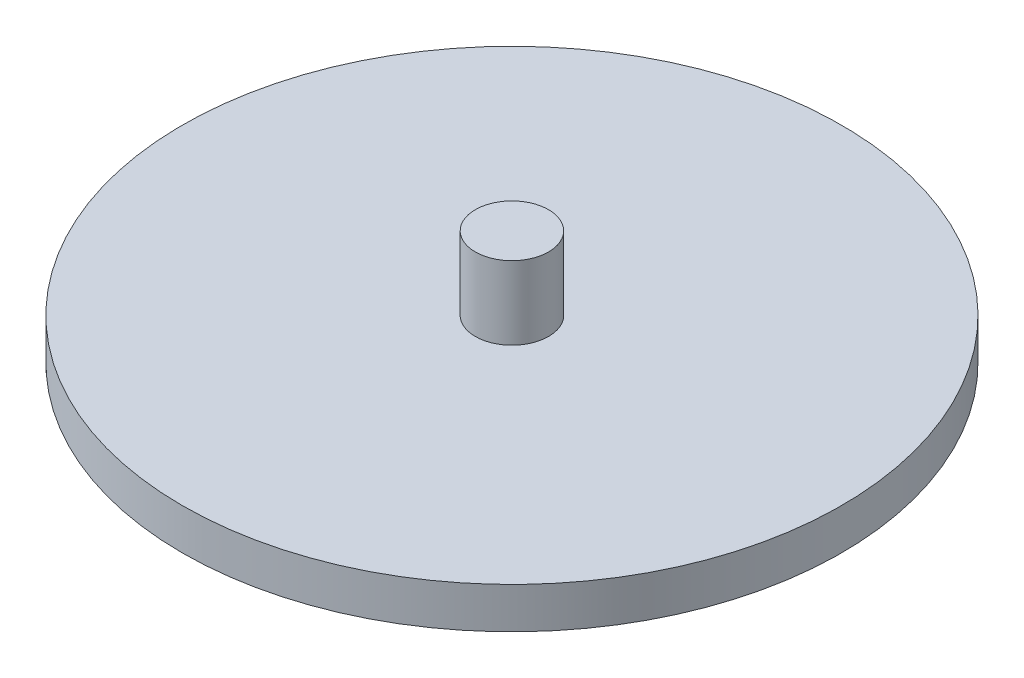
ISO-10303-21;
HEADER;
FILE_DESCRIPTION(('STEP AP214'),'2;1');
FILE_NAME('part.step','',(''),(''),'','','');
FILE_SCHEMA(('AUTOMOTIVE_DESIGN { 1 0 10303 214 1 1 1 1 }'));
ENDSEC;
DATA;
#1=APPLICATION_CONTEXT('core data for automotive mechanical design processes');
#2=APPLICATION_PROTOCOL_DEFINITION('international standard','automotive_design',2000,#1);
#3=PRODUCT_CONTEXT('',#1,'mechanical');
#4=PRODUCT('Part','Part','',(#3));
#5=PRODUCT_RELATED_PRODUCT_CATEGORY('part','',(#4));
#6=PRODUCT_DEFINITION_FORMATION('','',#4);
#7=PRODUCT_DEFINITION_CONTEXT('part definition',#1,'design');
#8=PRODUCT_DEFINITION('design','',#6,#7);
#9=PRODUCT_DEFINITION_SHAPE('','',#8);
#10=(LENGTH_UNIT() NAMED_UNIT(*) SI_UNIT(.MILLI.,.METRE.));
#11=(NAMED_UNIT(*) PLANE_ANGLE_UNIT() SI_UNIT($,.RADIAN.));
#12=(NAMED_UNIT(*) SI_UNIT($,.STERADIAN.) SOLID_ANGLE_UNIT());
#13=UNCERTAINTY_MEASURE_WITH_UNIT(LENGTH_MEASURE(1.E-05),#10,'distance_accuracy_value','');
#14=(GEOMETRIC_REPRESENTATION_CONTEXT(3) GLOBAL_UNCERTAINTY_ASSIGNED_CONTEXT((#13)) GLOBAL_UNIT_ASSIGNED_CONTEXT((#10,
#11,#12)) REPRESENTATION_CONTEXT('',''));
#15=CARTESIAN_POINT('',(0.,0.,0.));
#16=DIRECTION('',(0.,0.,1.));
#17=DIRECTION('',(1.,0.,0.));
#18=AXIS2_PLACEMENT_3D('',#15,#16,#17);
#19=CARTESIAN_POINT('',(0.,2.8,0.));
#20=DIRECTION('',(0.,-1.,0.));
#21=DIRECTION('',(0.,0.,-1.));
#22=AXIS2_PLACEMENT_3D('',#19,#20,#21);
#23=CYLINDRICAL_SURFACE('',#22,45.);
#24=CARTESIAN_POINT('',(0.,2.8,0.));
#25=DIRECTION('',(0.,1.,0.));
#26=DIRECTION('',(0.,0.,1.));
#27=AXIS2_PLACEMENT_3D('',#24,#25,#26);
#28=CIRCLE('',#27,45.);
#29=CARTESIAN_POINT('',(0.,2.8,45.));
#30=VERTEX_POINT('',#29);
#31=EDGE_CURVE('E10',#30,#30,#28,.T.);
#32=ORIENTED_EDGE('',*,*,#31,.F.);
#33=EDGE_LOOP('',(#32));
#34=FACE_BOUND('',#33,.T.);
#35=CARTESIAN_POINT('',(0.,-2.8,0.));
#36=DIRECTION('',(0.,1.,0.));
#37=DIRECTION('',(0.,0.,1.));
#38=AXIS2_PLACEMENT_3D('',#35,#36,#37);
#39=CIRCLE('',#38,45.);
#40=CARTESIAN_POINT('',(0.,-2.8,45.));
#41=VERTEX_POINT('',#40);
#42=EDGE_CURVE('E41',#41,#41,#39,.T.);
#43=ORIENTED_EDGE('',*,*,#42,.T.);
#44=EDGE_LOOP('',(#43));
#45=FACE_BOUND('',#44,.T.);
#46=ADVANCED_FACE('F34',(#34,#45),#23,.T.);
#47=CARTESIAN_POINT('',(0.,2.8,0.));
#48=DIRECTION('',(0.,1.,0.));
#49=DIRECTION('',(0.,0.,1.));
#50=AXIS2_PLACEMENT_3D('',#47,#48,#49);
#51=PLANE('',#50);
#52=CARTESIAN_POINT('',(0.,2.8,0.));
#53=DIRECTION('',(0.,1.,0.));
#54=DIRECTION('',(0.,0.,1.));
#55=AXIS2_PLACEMENT_3D('',#52,#53,#54);
#56=CIRCLE('',#55,5.);
#57=CARTESIAN_POINT('',(0.,2.8,5.));
#58=VERTEX_POINT('',#57);
#59=EDGE_CURVE('E48',#58,#58,#56,.T.);
#60=ORIENTED_EDGE('',*,*,#59,.F.);
#61=EDGE_LOOP('',(#60));
#62=FACE_BOUND('',#61,.T.);
#63=ORIENTED_EDGE('',*,*,#31,.T.);
#64=EDGE_LOOP('',(#63));
#65=FACE_BOUND('',#64,.T.);
#66=ADVANCED_FACE('F78',(#62,#65),#51,.T.);
#67=CARTESIAN_POINT('',(0.,-2.8,0.));
#68=DIRECTION('',(0.,1.,0.));
#69=DIRECTION('',(0.,0.,1.));
#70=AXIS2_PLACEMENT_3D('',#67,#68,#69);
#71=PLANE('',#70);
#72=CARTESIAN_POINT('',(0.,-2.8,0.));
#73=DIRECTION('',(0.,1.,0.));
#74=DIRECTION('',(0.,0.,1.));
#75=AXIS2_PLACEMENT_3D('',#72,#73,#74);
#76=CIRCLE('',#75,5.);
#77=CARTESIAN_POINT('',(0.,-2.8,5.));
#78=VERTEX_POINT('',#77);
#79=EDGE_CURVE('E37',#78,#78,#76,.T.);
#80=ORIENTED_EDGE('',*,*,#79,.T.);
#81=EDGE_LOOP('',(#80));
#82=FACE_BOUND('',#81,.T.);
#83=ORIENTED_EDGE('',*,*,#42,.F.);
#84=EDGE_LOOP('',(#83));
#85=FACE_BOUND('',#84,.T.);
#86=ADVANCED_FACE('F60',(#82,#85),#71,.F.);
#87=CARTESIAN_POINT('',(0.,12.8,0.));
#88=DIRECTION('',(0.,-1.,0.));
#89=DIRECTION('',(0.,0.,-1.));
#90=AXIS2_PLACEMENT_3D('',#87,#88,#89);
#91=CYLINDRICAL_SURFACE('',#90,5.);
#92=CARTESIAN_POINT('',(0.,12.8,0.));
#93=DIRECTION('',(0.,1.,0.));
#94=DIRECTION('',(0.,0.,1.));
#95=AXIS2_PLACEMENT_3D('',#92,#93,#94);
#96=CIRCLE('',#95,5.);
#97=CARTESIAN_POINT('',(0.,12.8,5.));
#98=VERTEX_POINT('',#97);
#99=EDGE_CURVE('E46',#98,#98,#96,.T.);
#100=ORIENTED_EDGE('',*,*,#99,.F.);
#101=EDGE_LOOP('',(#100));
#102=FACE_BOUND('',#101,.T.);
#103=ORIENTED_EDGE('',*,*,#59,.T.);
#104=EDGE_LOOP('',(#103));
#105=FACE_BOUND('',#104,.T.);
#106=ADVANCED_FACE('F74',(#102,#105),#91,.T.);
#107=CARTESIAN_POINT('',(0.,12.8,0.));
#108=DIRECTION('',(0.,1.,0.));
#109=DIRECTION('',(0.,0.,1.));
#110=AXIS2_PLACEMENT_3D('',#107,#108,#109);
#111=PLANE('',#110);
#112=ORIENTED_EDGE('',*,*,#99,.T.);
#113=EDGE_LOOP('',(#112));
#114=FACE_BOUND('',#113,.T.);
#115=ADVANCED_FACE('F66',(#114),#111,.T.);
#116=CARTESIAN_POINT('',(0.,-12.2,0.));
#117=DIRECTION('',(0.,1.,0.));
#118=DIRECTION('',(0.,0.,1.));
#119=AXIS2_PLACEMENT_3D('',#116,#117,#118);
#120=CYLINDRICAL_SURFACE('',#119,5.);
#121=CARTESIAN_POINT('',(0.,-12.2,0.));
#122=DIRECTION('',(0.,1.,0.));
#123=DIRECTION('',(0.,0.,1.));
#124=AXIS2_PLACEMENT_3D('',#121,#122,#123);
#125=CIRCLE('',#124,5.);
#126=CARTESIAN_POINT('',(0.,-12.2,5.));
#127=VERTEX_POINT('',#126);
#128=EDGE_CURVE('E53',#127,#127,#125,.T.);
#129=ORIENTED_EDGE('',*,*,#128,.T.);
#130=EDGE_LOOP('',(#129));
#131=FACE_BOUND('',#130,.T.);
#132=ORIENTED_EDGE('',*,*,#79,.F.);
#133=EDGE_LOOP('',(#132));
#134=FACE_BOUND('',#133,.T.);
#135=ADVANCED_FACE('F63',(#131,#134),#120,.T.);
#136=CARTESIAN_POINT('',(0.,-12.2,0.));
#137=DIRECTION('',(0.,1.,0.));
#138=DIRECTION('',(0.,0.,1.));
#139=AXIS2_PLACEMENT_3D('',#136,#137,#138);
#140=PLANE('',#139);
#141=ORIENTED_EDGE('',*,*,#128,.F.);
#142=EDGE_LOOP('',(#141));
#143=FACE_BOUND('',#142,.T.);
#144=ADVANCED_FACE('F65',(#143),#140,.F.);
#145=CLOSED_SHELL('',(#46,#66,#86,#106,#115,#135,#144));
#146=MANIFOLD_SOLID_BREP('B2',#145);
#147=ADVANCED_BREP_SHAPE_REPRESENTATION('',(#18,#146),#14);
#148=SHAPE_DEFINITION_REPRESENTATION(#9,#147);
ENDSEC;
END-ISO-10303-21;
